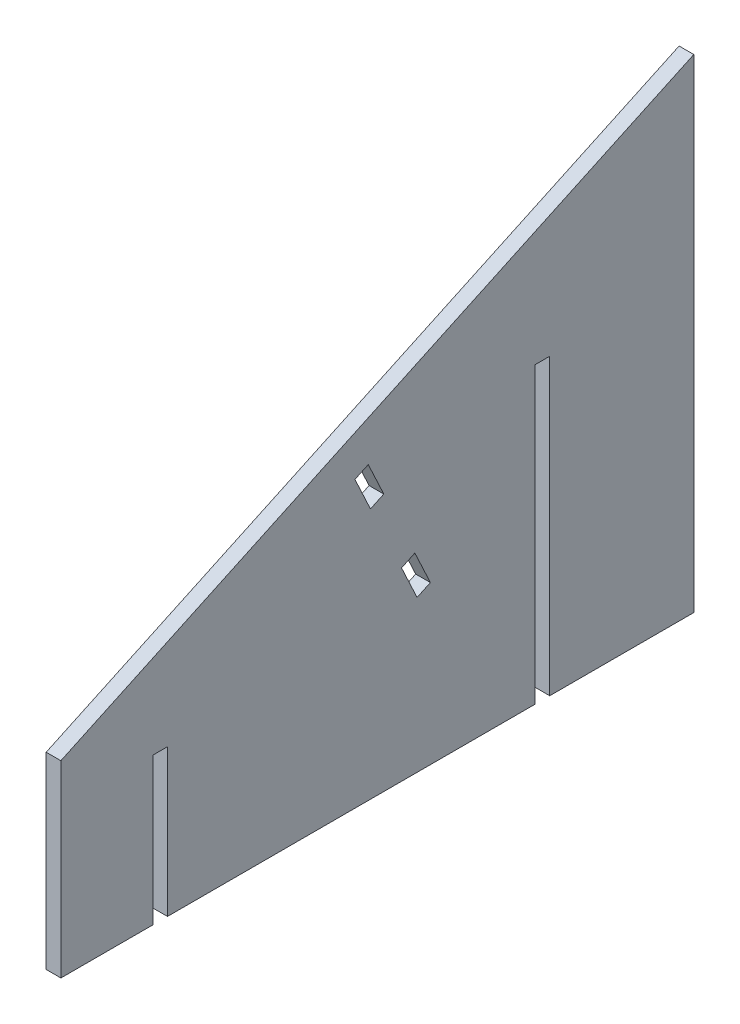
ISO-10303-21;
HEADER;
FILE_DESCRIPTION(('STEP AP214'),'2;1');
FILE_NAME('part.step','',(''),(''),'','','');
FILE_SCHEMA(('AUTOMOTIVE_DESIGN { 1 0 10303 214 1 1 1 1 }'));
ENDSEC;
DATA;
#1=APPLICATION_CONTEXT('core data for automotive mechanical design processes');
#2=APPLICATION_PROTOCOL_DEFINITION('international standard','automotive_design',2000,#1);
#3=PRODUCT_CONTEXT('',#1,'mechanical');
#4=PRODUCT('Part','Part','',(#3));
#5=PRODUCT_RELATED_PRODUCT_CATEGORY('part','',(#4));
#6=PRODUCT_DEFINITION_FORMATION('','',#4);
#7=PRODUCT_DEFINITION_CONTEXT('part definition',#1,'design');
#8=PRODUCT_DEFINITION('design','',#6,#7);
#9=PRODUCT_DEFINITION_SHAPE('','',#8);
#10=(LENGTH_UNIT() NAMED_UNIT(*) SI_UNIT(.MILLI.,.METRE.));
#11=(NAMED_UNIT(*) PLANE_ANGLE_UNIT() SI_UNIT($,.RADIAN.));
#12=(NAMED_UNIT(*) SI_UNIT($,.STERADIAN.) SOLID_ANGLE_UNIT());
#13=UNCERTAINTY_MEASURE_WITH_UNIT(LENGTH_MEASURE(1.E-05),#10,'distance_accuracy_value','');
#14=(GEOMETRIC_REPRESENTATION_CONTEXT(3) GLOBAL_UNCERTAINTY_ASSIGNED_CONTEXT((#13)) GLOBAL_UNIT_ASSIGNED_CONTEXT((#10,
#11,#12)) REPRESENTATION_CONTEXT('',''));
#15=CARTESIAN_POINT('',(0.,0.,0.));
#16=DIRECTION('',(0.,0.,1.));
#17=DIRECTION('',(1.,0.,0.));
#18=AXIS2_PLACEMENT_3D('',#15,#16,#17);
#19=CARTESIAN_POINT('',(5.08,-65.024,0.));
#20=DIRECTION('',(0.,1.,0.));
#21=DIRECTION('',(0.,0.,1.));
#22=AXIS2_PLACEMENT_3D('',#19,#20,#21);
#23=PLANE('',#22);
#24=DIRECTION('',(0.,0.,-1.));
#25=VECTOR('',#24,1.);
#26=CARTESIAN_POINT('',(0.,-65.024,0.));
#27=LINE('',#26,#25);
#28=CARTESIAN_POINT('',(0.,-65.024,0.));
#29=VERTEX_POINT('',#28);
#30=CARTESIAN_POINT('',(0.,-65.024,-31.75));
#31=VERTEX_POINT('',#30);
#32=EDGE_CURVE('E184',#29,#31,#27,.T.);
#33=ORIENTED_EDGE('',*,*,#32,.T.);
#34=DIRECTION('',(1.,0.,0.));
#35=VECTOR('',#34,1.);
#36=CARTESIAN_POINT('',(0.,-65.024,-31.75));
#37=LINE('',#36,#35);
#38=CARTESIAN_POINT('',(5.08,-65.024,-31.75));
#39=VERTEX_POINT('',#38);
#40=EDGE_CURVE('E170',#31,#39,#37,.T.);
#41=ORIENTED_EDGE('',*,*,#40,.T.);
#42=DIRECTION('',(0.,0.,-1.));
#43=VECTOR('',#42,1.);
#44=CARTESIAN_POINT('',(5.08,-65.024,0.));
#45=LINE('',#44,#43);
#46=CARTESIAN_POINT('',(5.08,-65.024,0.));
#47=VERTEX_POINT('',#46);
#48=EDGE_CURVE('E216',#47,#39,#45,.T.);
#49=ORIENTED_EDGE('',*,*,#48,.F.);
#50=DIRECTION('',(-1.,0.,0.));
#51=VECTOR('',#50,1.);
#52=CARTESIAN_POINT('',(5.08,-65.024,0.));
#53=LINE('',#52,#51);
#54=EDGE_CURVE('E11',#47,#29,#53,.T.);
#55=ORIENTED_EDGE('',*,*,#54,.T.);
#56=EDGE_LOOP('',(#33,#41,#49,#55));
#57=FACE_BOUND('',#56,.T.);
#58=ADVANCED_FACE('F33',(#57),#23,.F.);
#59=CARTESIAN_POINT('',(5.08,-65.024,-36.83));
#60=VERTEX_POINT('',#59);
#61=CARTESIAN_POINT('',(5.08,-65.024,-163.83));
#62=VERTEX_POINT('',#61);
#63=EDGE_CURVE('E218',#60,#62,#45,.T.);
#64=ORIENTED_EDGE('',*,*,#63,.F.);
#65=DIRECTION('',(1.,0.,0.));
#66=VECTOR('',#65,1.);
#67=CARTESIAN_POINT('',(0.,-65.024,-36.83));
#68=LINE('',#67,#66);
#69=CARTESIAN_POINT('',(0.,-65.024,-36.83));
#70=VERTEX_POINT('',#69);
#71=EDGE_CURVE('E179',#70,#60,#68,.T.);
#72=ORIENTED_EDGE('',*,*,#71,.F.);
#73=CARTESIAN_POINT('',(0.,-65.024,-163.83));
#74=VERTEX_POINT('',#73);
#75=EDGE_CURVE('E192',#70,#74,#27,.T.);
#76=ORIENTED_EDGE('',*,*,#75,.T.);
#77=DIRECTION('',(1.,0.,0.));
#78=VECTOR('',#77,1.);
#79=CARTESIAN_POINT('',(0.,-65.024,-163.83));
#80=LINE('',#79,#78);
#81=EDGE_CURVE('E285',#74,#62,#80,.T.);
#82=ORIENTED_EDGE('',*,*,#81,.T.);
#83=EDGE_LOOP('',(#64,#72,#76,#82));
#84=FACE_BOUND('',#83,.T.);
#85=ADVANCED_FACE('F327',(#84),#23,.F.);
#86=CARTESIAN_POINT('',(5.08,0.,0.));
#87=DIRECTION('',(0.,0.,-1.));
#88=DIRECTION('',(0.,1.,0.));
#89=AXIS2_PLACEMENT_3D('',#86,#87,#88);
#90=PLANE('',#89);
#91=DIRECTION('',(0.,-1.,0.));
#92=VECTOR('',#91,1.);
#93=CARTESIAN_POINT('',(0.,0.,0.));
#94=LINE('',#93,#92);
#95=CARTESIAN_POINT('',(0.,0.,0.));
#96=VERTEX_POINT('',#95);
#97=EDGE_CURVE('E199',#96,#29,#94,.T.);
#98=ORIENTED_EDGE('',*,*,#97,.T.);
#99=ORIENTED_EDGE('',*,*,#54,.F.);
#100=DIRECTION('',(0.,-1.,0.));
#101=VECTOR('',#100,1.);
#102=CARTESIAN_POINT('',(5.08,0.,0.));
#103=LINE('',#102,#101);
#104=CARTESIAN_POINT('',(5.08,0.,0.));
#105=VERTEX_POINT('',#104);
#106=EDGE_CURVE('E220',#105,#47,#103,.T.);
#107=ORIENTED_EDGE('',*,*,#106,.F.);
#108=DIRECTION('',(-1.,0.,0.));
#109=VECTOR('',#108,1.);
#110=CARTESIAN_POINT('',(5.08,0.,0.));
#111=LINE('',#110,#109);
#112=EDGE_CURVE('E213',#105,#96,#111,.T.);
#113=ORIENTED_EDGE('',*,*,#112,.T.);
#114=EDGE_LOOP('',(#98,#99,#107,#113));
#115=FACE_BOUND('',#114,.T.);
#116=ADVANCED_FACE('F35',(#115),#90,.F.);
#117=CARTESIAN_POINT('',(5.08,-65.024,-168.91));
#118=VERTEX_POINT('',#117);
#119=CARTESIAN_POINT('',(5.08,-65.024,-218.692069011943));
#120=VERTEX_POINT('',#119);
#121=EDGE_CURVE('E219',#118,#120,#45,.T.);
#122=ORIENTED_EDGE('',*,*,#121,.F.);
#123=DIRECTION('',(1.,0.,0.));
#124=VECTOR('',#123,1.);
#125=CARTESIAN_POINT('',(0.,-65.024,-168.91));
#126=LINE('',#125,#124);
#127=CARTESIAN_POINT('',(0.,-65.024,-168.91));
#128=VERTEX_POINT('',#127);
#129=EDGE_CURVE('E288',#128,#118,#126,.T.);
#130=ORIENTED_EDGE('',*,*,#129,.F.);
#131=CARTESIAN_POINT('',(0.,-65.024,-218.692069011943));
#132=VERTEX_POINT('',#131);
#133=EDGE_CURVE('E194',#128,#132,#27,.T.);
#134=ORIENTED_EDGE('',*,*,#133,.T.);
#135=DIRECTION('',(-1.,0.,0.));
#136=VECTOR('',#135,1.);
#137=CARTESIAN_POINT('',(5.08,-65.024,-218.692069011943));
#138=LINE('',#137,#136);
#139=EDGE_CURVE('E41',#120,#132,#138,.T.);
#140=ORIENTED_EDGE('',*,*,#139,.F.);
#141=EDGE_LOOP('',(#122,#130,#134,#140));
#142=FACE_BOUND('',#141,.T.);
#143=ADVANCED_FACE('F338',(#142),#23,.F.);
#144=CARTESIAN_POINT('',(5.08,101.977786558031,-218.692069011943));
#145=DIRECTION('',(0.,0.,1.));
#146=DIRECTION('',(0.,-1.,0.));
#147=AXIS2_PLACEMENT_3D('',#144,#145,#146);
#148=PLANE('',#147);
#149=DIRECTION('',(0.,1.,0.));
#150=VECTOR('',#149,1.);
#151=CARTESIAN_POINT('',(0.,101.977786558031,-218.692069011943));
#152=LINE('',#151,#150);
#153=CARTESIAN_POINT('',(0.,101.977786558031,-218.692069011943));
#154=VERTEX_POINT('',#153);
#155=EDGE_CURVE('E191',#132,#154,#152,.T.);
#156=ORIENTED_EDGE('',*,*,#155,.T.);
#157=DIRECTION('',(-1.,0.,0.));
#158=VECTOR('',#157,1.);
#159=CARTESIAN_POINT('',(5.08,101.977786558031,-218.692069011943));
#160=LINE('',#159,#158);
#161=CARTESIAN_POINT('',(5.08,101.977786558031,-218.692069011943));
#162=VERTEX_POINT('',#161);
#163=EDGE_CURVE('E341',#162,#154,#160,.T.);
#164=ORIENTED_EDGE('',*,*,#163,.F.);
#165=DIRECTION('',(0.,1.,0.));
#166=VECTOR('',#165,1.);
#167=CARTESIAN_POINT('',(5.08,101.977786558031,-218.692069011943));
#168=LINE('',#167,#166);
#169=EDGE_CURVE('E214',#120,#162,#168,.T.);
#170=ORIENTED_EDGE('',*,*,#169,.F.);
#171=ORIENTED_EDGE('',*,*,#139,.T.);
#172=EDGE_LOOP('',(#156,#164,#170,#171));
#173=FACE_BOUND('',#172,.T.);
#174=ADVANCED_FACE('F342',(#173),#148,.F.);
#175=CARTESIAN_POINT('',(5.08,0.,0.));
#176=DIRECTION('',(0.,-0.906307787036649,-0.422618261740701));
#177=DIRECTION('',(0.,0.422618261740701,-0.906307787036649));
#178=AXIS2_PLACEMENT_3D('',#175,#176,#177);
#179=PLANE('',#178);
#180=DIRECTION('',(0.,-0.422618261740701,0.906307787036649));
#181=VECTOR('',#180,1.);
#182=CARTESIAN_POINT('',(0.,0.,0.));
#183=LINE('',#182,#181);
#184=EDGE_CURVE('E195',#154,#96,#183,.T.);
#185=ORIENTED_EDGE('',*,*,#184,.T.);
#186=ORIENTED_EDGE('',*,*,#112,.F.);
#187=DIRECTION('',(0.,-0.422618261740701,0.906307787036649));
#188=VECTOR('',#187,1.);
#189=CARTESIAN_POINT('',(5.08,0.,0.));
#190=LINE('',#189,#188);
#191=EDGE_CURVE('E211',#162,#105,#190,.T.);
#192=ORIENTED_EDGE('',*,*,#191,.F.);
#193=ORIENTED_EDGE('',*,*,#163,.T.);
#194=EDGE_LOOP('',(#185,#186,#192,#193));
#195=FACE_BOUND('',#194,.T.);
#196=ADVANCED_FACE('F349',(#195),#179,.F.);
#197=CARTESIAN_POINT('',(5.08,0.,0.));
#198=DIRECTION('',(1.,0.,0.));
#199=DIRECTION('',(0.,0.,-1.));
#200=AXIS2_PLACEMENT_3D('',#197,#198,#199);
#201=PLANE('',#200);
#202=DIRECTION('',(0.,-1.,0.));
#203=VECTOR('',#202,1.);
#204=CARTESIAN_POINT('',(5.08,-65.024,-31.75));
#205=LINE('',#204,#203);
#206=CARTESIAN_POINT('',(5.08,-14.224,-31.75));
#207=VERTEX_POINT('',#206);
#208=EDGE_CURVE('E175',#207,#39,#205,.T.);
#209=ORIENTED_EDGE('',*,*,#208,.F.);
#210=DIRECTION('',(0.,0.,1.));
#211=VECTOR('',#210,1.);
#212=CARTESIAN_POINT('',(5.08,-14.224,-31.75));
#213=LINE('',#212,#211);
#214=CARTESIAN_POINT('',(5.08,-14.224,-36.83));
#215=VERTEX_POINT('',#214);
#216=EDGE_CURVE('E187',#215,#207,#213,.T.);
#217=ORIENTED_EDGE('',*,*,#216,.F.);
#218=DIRECTION('',(0.,1.,0.));
#219=VECTOR('',#218,1.);
#220=CARTESIAN_POINT('',(5.08,-65.024,-36.83));
#221=LINE('',#220,#219);
#222=EDGE_CURVE('E315',#60,#215,#221,.T.);
#223=ORIENTED_EDGE('',*,*,#222,.F.);
#224=ORIENTED_EDGE('',*,*,#63,.T.);
#225=DIRECTION('',(0.,-1.,0.));
#226=VECTOR('',#225,1.);
#227=CARTESIAN_POINT('',(5.08,-65.024,-163.83));
#228=LINE('',#227,#226);
#229=CARTESIAN_POINT('',(5.08,36.576,-163.83));
#230=VERTEX_POINT('',#229);
#231=EDGE_CURVE('E301',#230,#62,#228,.T.);
#232=ORIENTED_EDGE('',*,*,#231,.F.);
#233=DIRECTION('',(0.,0.,1.));
#234=VECTOR('',#233,1.);
#235=CARTESIAN_POINT('',(5.08,36.576,-163.83));
#236=LINE('',#235,#234);
#237=CARTESIAN_POINT('',(5.08,36.576,-168.91));
#238=VERTEX_POINT('',#237);
#239=EDGE_CURVE('E294',#238,#230,#236,.T.);
#240=ORIENTED_EDGE('',*,*,#239,.F.);
#241=DIRECTION('',(0.,1.,0.));
#242=VECTOR('',#241,1.);
#243=CARTESIAN_POINT('',(5.08,-65.024,-168.91));
#244=LINE('',#243,#242);
#245=EDGE_CURVE('E298',#118,#238,#244,.T.);
#246=ORIENTED_EDGE('',*,*,#245,.F.);
#247=ORIENTED_EDGE('',*,*,#121,.T.);
#248=ORIENTED_EDGE('',*,*,#169,.T.);
#249=ORIENTED_EDGE('',*,*,#191,.T.);
#250=ORIENTED_EDGE('',*,*,#106,.T.);
#251=ORIENTED_EDGE('',*,*,#48,.T.);
#252=EDGE_LOOP('',(#209,#217,#223,#224,#232,#240,#246,#247,#248,#249,#250,#251));
#253=FACE_BOUND('',#252,.T.);
#254=DIRECTION('',(0.,-0.90630778703665,-0.4226182617407));
#255=VECTOR('',#254,1.);
#256=CARTESIAN_POINT('',(5.08,-1.16636818837194,-117.701755772321));
#257=LINE('',#256,#255);
#258=CARTESIAN_POINT('',(5.08,-1.16636818837194,-117.701755772321));
#259=VERTEX_POINT('',#258);
#260=CARTESIAN_POINT('',(5.08,-12.6764770837374,-123.069007696428));
#261=VERTEX_POINT('',#260);
#262=EDGE_CURVE('E272',#259,#261,#257,.T.);
#263=ORIENTED_EDGE('',*,*,#262,.F.);
#264=DIRECTION('',(0.,-0.422618261740701,0.906307787036649));
#265=VECTOR('',#264,1.);
#266=CARTESIAN_POINT('',(5.08,-1.16636818837194,-117.701755772321));
#267=LINE('',#266,#265);
#268=CARTESIAN_POINT('',(5.08,0.980532581270822,-122.305799330467));
#269=VERTEX_POINT('',#268);
#270=EDGE_CURVE('E262',#269,#259,#267,.T.);
#271=ORIENTED_EDGE('',*,*,#270,.F.);
#272=DIRECTION('',(0.,0.906307787036649,0.422618261740701));
#273=VECTOR('',#272,1.);
#274=CARTESIAN_POINT('',(5.08,0.980532581270822,-122.305799330467));
#275=LINE('',#274,#273);
#276=CARTESIAN_POINT('',(5.08,-10.5295763140946,-127.673051254574));
#277=VERTEX_POINT('',#276);
#278=EDGE_CURVE('E266',#277,#269,#275,.T.);
#279=ORIENTED_EDGE('',*,*,#278,.F.);
#280=DIRECTION('',(0.,0.422618261740701,-0.906307787036649));
#281=VECTOR('',#280,1.);
#282=CARTESIAN_POINT('',(5.08,-12.6764770837374,-123.069007696428));
#283=LINE('',#282,#281);
#284=EDGE_CURVE('E269',#261,#277,#283,.T.);
#285=ORIENTED_EDGE('',*,*,#284,.F.);
#286=EDGE_LOOP('',(#263,#271,#279,#285));
#287=FACE_BOUND('',#286,.T.);
#288=DIRECTION('',(0.,-0.90630778703665,-0.4226182617407));
#289=VECTOR('',#288,1.);
#290=CARTESIAN_POINT('',(5.08,33.3639584977244,-101.6));
#291=LINE('',#290,#289);
#292=CARTESIAN_POINT('',(5.08,33.3639584977244,-101.6));
#293=VERTEX_POINT('',#292);
#294=CARTESIAN_POINT('',(5.08,21.853849602359,-106.967251924107));
#295=VERTEX_POINT('',#294);
#296=EDGE_CURVE('E240',#293,#295,#291,.T.);
#297=ORIENTED_EDGE('',*,*,#296,.F.);
#298=DIRECTION('',(0.,-0.422618261740701,0.906307787036649));
#299=VECTOR('',#298,1.);
#300=CARTESIAN_POINT('',(5.08,33.3639584977244,-101.6));
#301=LINE('',#300,#299);
#302=CARTESIAN_POINT('',(5.08,35.5108592673672,-106.204043558146));
#303=VERTEX_POINT('',#302);
#304=EDGE_CURVE('E230',#303,#293,#301,.T.);
#305=ORIENTED_EDGE('',*,*,#304,.F.);
#306=DIRECTION('',(0.,0.906307787036649,0.422618261740701));
#307=VECTOR('',#306,1.);
#308=CARTESIAN_POINT('',(5.08,35.5108592673672,-106.204043558146));
#309=LINE('',#308,#307);
#310=CARTESIAN_POINT('',(5.08,24.0007503720017,-111.571295482253));
#311=VERTEX_POINT('',#310);
#312=EDGE_CURVE('E234',#311,#303,#309,.T.);
#313=ORIENTED_EDGE('',*,*,#312,.F.);
#314=DIRECTION('',(0.,0.422618261740701,-0.906307787036649));
#315=VECTOR('',#314,1.);
#316=CARTESIAN_POINT('',(5.08,21.853849602359,-106.967251924107));
#317=LINE('',#316,#315);
#318=EDGE_CURVE('E237',#295,#311,#317,.T.);
#319=ORIENTED_EDGE('',*,*,#318,.F.);
#320=EDGE_LOOP('',(#297,#305,#313,#319));
#321=FACE_BOUND('',#320,.T.);
#322=ADVANCED_FACE('F333',(#253,#287,#321),#201,.T.);
#323=CARTESIAN_POINT('',(0.,0.,0.));
#324=DIRECTION('',(1.,0.,0.));
#325=DIRECTION('',(0.,0.,-1.));
#326=AXIS2_PLACEMENT_3D('',#323,#324,#325);
#327=PLANE('',#326);
#328=DIRECTION('',(0.,-0.422618261740701,0.906307787036649));
#329=VECTOR('',#328,1.);
#330=CARTESIAN_POINT('',(0.,-1.16636818837194,-117.701755772321));
#331=LINE('',#330,#329);
#332=CARTESIAN_POINT('',(0.,0.980532581270822,-122.305799330467));
#333=VERTEX_POINT('',#332);
#334=CARTESIAN_POINT('',(0.,-1.16636818837194,-117.701755772321));
#335=VERTEX_POINT('',#334);
#336=EDGE_CURVE('E257',#333,#335,#331,.T.);
#337=ORIENTED_EDGE('',*,*,#336,.T.);
#338=DIRECTION('',(0.,-0.90630778703665,-0.4226182617407));
#339=VECTOR('',#338,1.);
#340=CARTESIAN_POINT('',(0.,-1.16636818837194,-117.701755772321));
#341=LINE('',#340,#339);
#342=CARTESIAN_POINT('',(0.,-12.6764770837374,-123.069007696428));
#343=VERTEX_POINT('',#342);
#344=EDGE_CURVE('E265',#335,#343,#341,.T.);
#345=ORIENTED_EDGE('',*,*,#344,.T.);
#346=DIRECTION('',(0.,0.422618261740701,-0.906307787036649));
#347=VECTOR('',#346,1.);
#348=CARTESIAN_POINT('',(0.,-12.6764770837374,-123.069007696428));
#349=LINE('',#348,#347);
#350=CARTESIAN_POINT('',(0.,-10.5295763140946,-127.673051254574));
#351=VERTEX_POINT('',#350);
#352=EDGE_CURVE('E280',#343,#351,#349,.T.);
#353=ORIENTED_EDGE('',*,*,#352,.T.);
#354=DIRECTION('',(0.,0.906307787036649,0.422618261740701));
#355=VECTOR('',#354,1.);
#356=CARTESIAN_POINT('',(0.,0.980532581270822,-122.305799330467));
#357=LINE('',#356,#355);
#358=EDGE_CURVE('E277',#351,#333,#357,.T.);
#359=ORIENTED_EDGE('',*,*,#358,.T.);
#360=EDGE_LOOP('',(#337,#345,#353,#359));
#361=FACE_BOUND('',#360,.T.);
#362=DIRECTION('',(0.,-0.422618261740701,0.906307787036649));
#363=VECTOR('',#362,1.);
#364=CARTESIAN_POINT('',(0.,33.3639584977244,-101.6));
#365=LINE('',#364,#363);
#366=CARTESIAN_POINT('',(0.,35.5108592673672,-106.204043558146));
#367=VERTEX_POINT('',#366);
#368=CARTESIAN_POINT('',(0.,33.3639584977244,-101.6));
#369=VERTEX_POINT('',#368);
#370=EDGE_CURVE('E227',#367,#369,#365,.T.);
#371=ORIENTED_EDGE('',*,*,#370,.T.);
#372=DIRECTION('',(0.,-0.90630778703665,-0.4226182617407));
#373=VECTOR('',#372,1.);
#374=CARTESIAN_POINT('',(0.,33.3639584977244,-101.6));
#375=LINE('',#374,#373);
#376=CARTESIAN_POINT('',(0.,21.853849602359,-106.967251924107));
#377=VERTEX_POINT('',#376);
#378=EDGE_CURVE('E233',#369,#377,#375,.T.);
#379=ORIENTED_EDGE('',*,*,#378,.T.);
#380=DIRECTION('',(0.,0.422618261740701,-0.906307787036649));
#381=VECTOR('',#380,1.);
#382=CARTESIAN_POINT('',(0.,21.853849602359,-106.967251924107));
#383=LINE('',#382,#381);
#384=CARTESIAN_POINT('',(0.,24.0007503720017,-111.571295482253));
#385=VERTEX_POINT('',#384);
#386=EDGE_CURVE('E248',#377,#385,#383,.T.);
#387=ORIENTED_EDGE('',*,*,#386,.T.);
#388=DIRECTION('',(0.,0.906307787036649,0.422618261740701));
#389=VECTOR('',#388,1.);
#390=CARTESIAN_POINT('',(0.,35.5108592673672,-106.204043558146));
#391=LINE('',#390,#389);
#392=EDGE_CURVE('E245',#385,#367,#391,.T.);
#393=ORIENTED_EDGE('',*,*,#392,.T.);
#394=EDGE_LOOP('',(#371,#379,#387,#393));
#395=FACE_BOUND('',#394,.T.);
#396=DIRECTION('',(0.,0.,1.));
#397=VECTOR('',#396,1.);
#398=CARTESIAN_POINT('',(0.,-14.224,-31.75));
#399=LINE('',#398,#397);
#400=CARTESIAN_POINT('',(0.,-14.224,-36.83));
#401=VERTEX_POINT('',#400);
#402=CARTESIAN_POINT('',(0.,-14.224,-31.75));
#403=VERTEX_POINT('',#402);
#404=EDGE_CURVE('E48',#401,#403,#399,.T.);
#405=ORIENTED_EDGE('',*,*,#404,.T.);
#406=DIRECTION('',(0.,-1.,0.));
#407=VECTOR('',#406,1.);
#408=CARTESIAN_POINT('',(0.,-65.024,-31.75));
#409=LINE('',#408,#407);
#410=EDGE_CURVE('E173',#403,#31,#409,.T.);
#411=ORIENTED_EDGE('',*,*,#410,.T.);
#412=ORIENTED_EDGE('',*,*,#32,.F.);
#413=ORIENTED_EDGE('',*,*,#97,.F.);
#414=ORIENTED_EDGE('',*,*,#184,.F.);
#415=ORIENTED_EDGE('',*,*,#155,.F.);
#416=ORIENTED_EDGE('',*,*,#133,.F.);
#417=DIRECTION('',(0.,1.,0.));
#418=VECTOR('',#417,1.);
#419=CARTESIAN_POINT('',(0.,-65.024,-168.91));
#420=LINE('',#419,#418);
#421=CARTESIAN_POINT('',(0.,36.576,-168.91));
#422=VERTEX_POINT('',#421);
#423=EDGE_CURVE('E304',#128,#422,#420,.T.);
#424=ORIENTED_EDGE('',*,*,#423,.T.);
#425=DIRECTION('',(0.,0.,1.));
#426=VECTOR('',#425,1.);
#427=CARTESIAN_POINT('',(0.,36.576,-163.83));
#428=LINE('',#427,#426);
#429=CARTESIAN_POINT('',(0.,36.576,-163.83));
#430=VERTEX_POINT('',#429);
#431=EDGE_CURVE('E56',#422,#430,#428,.T.);
#432=ORIENTED_EDGE('',*,*,#431,.T.);
#433=DIRECTION('',(0.,-1.,0.));
#434=VECTOR('',#433,1.);
#435=CARTESIAN_POINT('',(0.,-65.024,-163.83));
#436=LINE('',#435,#434);
#437=EDGE_CURVE('E297',#430,#74,#436,.T.);
#438=ORIENTED_EDGE('',*,*,#437,.T.);
#439=ORIENTED_EDGE('',*,*,#75,.F.);
#440=DIRECTION('',(0.,1.,0.));
#441=VECTOR('',#440,1.);
#442=CARTESIAN_POINT('',(0.,-65.024,-36.83));
#443=LINE('',#442,#441);
#444=EDGE_CURVE('E186',#70,#401,#443,.T.);
#445=ORIENTED_EDGE('',*,*,#444,.T.);
#446=EDGE_LOOP('',(#405,#411,#412,#413,#414,#415,#416,#424,#432,#438,#439,#445));
#447=FACE_BOUND('',#446,.T.);
#448=ADVANCED_FACE('F182',(#361,#395,#447),#327,.F.);
#449=CARTESIAN_POINT('',(0.,33.3639584977244,-101.6));
#450=DIRECTION('',(0.,-0.4226182617407,0.90630778703665));
#451=DIRECTION('',(0.,-0.90630778703665,-0.4226182617407));
#452=AXIS2_PLACEMENT_3D('',#449,#450,#451);
#453=PLANE('',#452);
#454=ORIENTED_EDGE('',*,*,#296,.T.);
#455=DIRECTION('',(1.,0.,0.));
#456=VECTOR('',#455,1.);
#457=CARTESIAN_POINT('',(0.,21.853849602359,-106.967251924107));
#458=LINE('',#457,#456);
#459=EDGE_CURVE('E223',#377,#295,#458,.T.);
#460=ORIENTED_EDGE('',*,*,#459,.F.);
#461=ORIENTED_EDGE('',*,*,#378,.F.);
#462=DIRECTION('',(1.,0.,0.));
#463=VECTOR('',#462,1.);
#464=CARTESIAN_POINT('',(0.,33.3639584977244,-101.6));
#465=LINE('',#464,#463);
#466=EDGE_CURVE('E205',#369,#293,#465,.T.);
#467=ORIENTED_EDGE('',*,*,#466,.T.);
#468=EDGE_LOOP('',(#454,#460,#461,#467));
#469=FACE_BOUND('',#468,.T.);
#470=ADVANCED_FACE('F368',(#469),#453,.F.);
#471=CARTESIAN_POINT('',(0.,33.3639584977244,-101.6));
#472=DIRECTION('',(0.,0.906307787036649,0.422618261740701));
#473=DIRECTION('',(0.,-0.422618261740701,0.906307787036649));
#474=AXIS2_PLACEMENT_3D('',#471,#472,#473);
#475=PLANE('',#474);
#476=ORIENTED_EDGE('',*,*,#304,.T.);
#477=ORIENTED_EDGE('',*,*,#466,.F.);
#478=ORIENTED_EDGE('',*,*,#370,.F.);
#479=DIRECTION('',(1.,0.,0.));
#480=VECTOR('',#479,1.);
#481=CARTESIAN_POINT('',(0.,35.5108592673672,-106.204043558146));
#482=LINE('',#481,#480);
#483=EDGE_CURVE('E208',#367,#303,#482,.T.);
#484=ORIENTED_EDGE('',*,*,#483,.T.);
#485=EDGE_LOOP('',(#476,#477,#478,#484));
#486=FACE_BOUND('',#485,.T.);
#487=ADVANCED_FACE('F374',(#486),#475,.F.);
#488=CARTESIAN_POINT('',(0.,35.5108592673672,-106.204043558146));
#489=DIRECTION('',(0.,0.422618261740701,-0.906307787036649));
#490=DIRECTION('',(0.,0.906307787036649,0.422618261740701));
#491=AXIS2_PLACEMENT_3D('',#488,#489,#490);
#492=PLANE('',#491);
#493=ORIENTED_EDGE('',*,*,#312,.T.);
#494=ORIENTED_EDGE('',*,*,#483,.F.);
#495=ORIENTED_EDGE('',*,*,#392,.F.);
#496=DIRECTION('',(1.,0.,0.));
#497=VECTOR('',#496,1.);
#498=CARTESIAN_POINT('',(0.,24.0007503720017,-111.571295482253));
#499=LINE('',#498,#497);
#500=EDGE_CURVE('E226',#385,#311,#499,.T.);
#501=ORIENTED_EDGE('',*,*,#500,.T.);
#502=EDGE_LOOP('',(#493,#494,#495,#501));
#503=FACE_BOUND('',#502,.T.);
#504=ADVANCED_FACE('F380',(#503),#492,.F.);
#505=CARTESIAN_POINT('',(0.,21.853849602359,-106.967251924107));
#506=DIRECTION('',(0.,-0.906307787036649,-0.422618261740701));
#507=DIRECTION('',(0.,0.422618261740701,-0.906307787036649));
#508=AXIS2_PLACEMENT_3D('',#505,#506,#507);
#509=PLANE('',#508);
#510=ORIENTED_EDGE('',*,*,#318,.T.);
#511=ORIENTED_EDGE('',*,*,#500,.F.);
#512=ORIENTED_EDGE('',*,*,#386,.F.);
#513=ORIENTED_EDGE('',*,*,#459,.T.);
#514=EDGE_LOOP('',(#510,#511,#512,#513));
#515=FACE_BOUND('',#514,.T.);
#516=ADVANCED_FACE('F376',(#515),#509,.F.);
#517=CARTESIAN_POINT('',(0.,-1.16636818837194,-117.701755772321));
#518=DIRECTION('',(0.,-0.4226182617407,0.90630778703665));
#519=DIRECTION('',(0.,-0.90630778703665,-0.4226182617407));
#520=AXIS2_PLACEMENT_3D('',#517,#518,#519);
#521=PLANE('',#520);
#522=ORIENTED_EDGE('',*,*,#262,.T.);
#523=DIRECTION('',(1.,0.,0.));
#524=VECTOR('',#523,1.);
#525=CARTESIAN_POINT('',(0.,-12.6764770837374,-123.069007696428));
#526=LINE('',#525,#524);
#527=EDGE_CURVE('E253',#343,#261,#526,.T.);
#528=ORIENTED_EDGE('',*,*,#527,.F.);
#529=ORIENTED_EDGE('',*,*,#344,.F.);
#530=DIRECTION('',(1.,0.,0.));
#531=VECTOR('',#530,1.);
#532=CARTESIAN_POINT('',(0.,-1.16636818837194,-117.701755772321));
#533=LINE('',#532,#531);
#534=EDGE_CURVE('E242',#335,#259,#533,.T.);
#535=ORIENTED_EDGE('',*,*,#534,.T.);
#536=EDGE_LOOP('',(#522,#528,#529,#535));
#537=FACE_BOUND('',#536,.T.);
#538=ADVANCED_FACE('F379',(#537),#521,.F.);
#539=CARTESIAN_POINT('',(0.,-1.16636818837194,-117.701755772321));
#540=DIRECTION('',(0.,0.906307787036649,0.422618261740701));
#541=DIRECTION('',(0.,-0.422618261740701,0.906307787036649));
#542=AXIS2_PLACEMENT_3D('',#539,#540,#541);
#543=PLANE('',#542);
#544=ORIENTED_EDGE('',*,*,#270,.T.);
#545=ORIENTED_EDGE('',*,*,#534,.F.);
#546=ORIENTED_EDGE('',*,*,#336,.F.);
#547=DIRECTION('',(1.,0.,0.));
#548=VECTOR('',#547,1.);
#549=CARTESIAN_POINT('',(0.,0.980532581270822,-122.305799330467));
#550=LINE('',#549,#548);
#551=EDGE_CURVE('E259',#333,#269,#550,.T.);
#552=ORIENTED_EDGE('',*,*,#551,.T.);
#553=EDGE_LOOP('',(#544,#545,#546,#552));
#554=FACE_BOUND('',#553,.T.);
#555=ADVANCED_FACE('F390',(#554),#543,.F.);
#556=CARTESIAN_POINT('',(0.,0.980532581270822,-122.305799330467));
#557=DIRECTION('',(0.,0.422618261740701,-0.906307787036649));
#558=DIRECTION('',(0.,0.906307787036649,0.422618261740701));
#559=AXIS2_PLACEMENT_3D('',#556,#557,#558);
#560=PLANE('',#559);
#561=ORIENTED_EDGE('',*,*,#278,.T.);
#562=ORIENTED_EDGE('',*,*,#551,.F.);
#563=ORIENTED_EDGE('',*,*,#358,.F.);
#564=DIRECTION('',(1.,0.,0.));
#565=VECTOR('',#564,1.);
#566=CARTESIAN_POINT('',(0.,-10.5295763140946,-127.673051254574));
#567=LINE('',#566,#565);
#568=EDGE_CURVE('E256',#351,#277,#567,.T.);
#569=ORIENTED_EDGE('',*,*,#568,.T.);
#570=EDGE_LOOP('',(#561,#562,#563,#569));
#571=FACE_BOUND('',#570,.T.);
#572=ADVANCED_FACE('F396',(#571),#560,.F.);
#573=CARTESIAN_POINT('',(0.,-12.6764770837374,-123.069007696428));
#574=DIRECTION('',(0.,-0.906307787036649,-0.422618261740701));
#575=DIRECTION('',(0.,0.422618261740701,-0.906307787036649));
#576=AXIS2_PLACEMENT_3D('',#573,#574,#575);
#577=PLANE('',#576);
#578=ORIENTED_EDGE('',*,*,#284,.T.);
#579=ORIENTED_EDGE('',*,*,#568,.F.);
#580=ORIENTED_EDGE('',*,*,#352,.F.);
#581=ORIENTED_EDGE('',*,*,#527,.T.);
#582=EDGE_LOOP('',(#578,#579,#580,#581));
#583=FACE_BOUND('',#582,.T.);
#584=ADVANCED_FACE('F392',(#583),#577,.F.);
#585=CARTESIAN_POINT('',(0.,-65.024,-163.83));
#586=DIRECTION('',(0.,0.,1.));
#587=DIRECTION('',(1.,0.,0.));
#588=AXIS2_PLACEMENT_3D('',#585,#586,#587);
#589=PLANE('',#588);
#590=ORIENTED_EDGE('',*,*,#231,.T.);
#591=ORIENTED_EDGE('',*,*,#81,.F.);
#592=ORIENTED_EDGE('',*,*,#437,.F.);
#593=DIRECTION('',(1.,0.,0.));
#594=VECTOR('',#593,1.);
#595=CARTESIAN_POINT('',(0.,36.576,-163.83));
#596=LINE('',#595,#594);
#597=EDGE_CURVE('E292',#430,#230,#596,.T.);
#598=ORIENTED_EDGE('',*,*,#597,.T.);
#599=EDGE_LOOP('',(#590,#591,#592,#598));
#600=FACE_BOUND('',#599,.T.);
#601=ADVANCED_FACE('F395',(#600),#589,.F.);
#602=CARTESIAN_POINT('',(0.,36.576,-163.83));
#603=DIRECTION('',(0.,1.,0.));
#604=DIRECTION('',(0.,0.,1.));
#605=AXIS2_PLACEMENT_3D('',#602,#603,#604);
#606=PLANE('',#605);
#607=ORIENTED_EDGE('',*,*,#239,.T.);
#608=ORIENTED_EDGE('',*,*,#597,.F.);
#609=ORIENTED_EDGE('',*,*,#431,.F.);
#610=DIRECTION('',(1.,0.,0.));
#611=VECTOR('',#610,1.);
#612=CARTESIAN_POINT('',(0.,36.576,-168.91));
#613=LINE('',#612,#611);
#614=EDGE_CURVE('E290',#422,#238,#613,.T.);
#615=ORIENTED_EDGE('',*,*,#614,.T.);
#616=EDGE_LOOP('',(#607,#608,#609,#615));
#617=FACE_BOUND('',#616,.T.);
#618=ADVANCED_FACE('F406',(#617),#606,.F.);
#619=CARTESIAN_POINT('',(0.,-65.024,-168.91));
#620=DIRECTION('',(0.,0.,-1.));
#621=DIRECTION('',(-1.,0.,0.));
#622=AXIS2_PLACEMENT_3D('',#619,#620,#621);
#623=PLANE('',#622);
#624=ORIENTED_EDGE('',*,*,#245,.T.);
#625=ORIENTED_EDGE('',*,*,#614,.F.);
#626=ORIENTED_EDGE('',*,*,#423,.F.);
#627=ORIENTED_EDGE('',*,*,#129,.T.);
#628=EDGE_LOOP('',(#624,#625,#626,#627));
#629=FACE_BOUND('',#628,.T.);
#630=ADVANCED_FACE('F408',(#629),#623,.F.);
#631=CARTESIAN_POINT('',(0.,-65.024,-31.75));
#632=DIRECTION('',(0.,0.,1.));
#633=DIRECTION('',(1.,0.,0.));
#634=AXIS2_PLACEMENT_3D('',#631,#632,#633);
#635=PLANE('',#634);
#636=ORIENTED_EDGE('',*,*,#208,.T.);
#637=ORIENTED_EDGE('',*,*,#40,.F.);
#638=ORIENTED_EDGE('',*,*,#410,.F.);
#639=DIRECTION('',(1.,0.,0.));
#640=VECTOR('',#639,1.);
#641=CARTESIAN_POINT('',(0.,-14.224,-31.75));
#642=LINE('',#641,#640);
#643=EDGE_CURVE('E274',#403,#207,#642,.T.);
#644=ORIENTED_EDGE('',*,*,#643,.T.);
#645=EDGE_LOOP('',(#636,#637,#638,#644));
#646=FACE_BOUND('',#645,.T.);
#647=ADVANCED_FACE('F172',(#646),#635,.F.);
#648=CARTESIAN_POINT('',(0.,-14.224,-31.75));
#649=DIRECTION('',(0.,1.,0.));
#650=DIRECTION('',(0.,0.,1.));
#651=AXIS2_PLACEMENT_3D('',#648,#649,#650);
#652=PLANE('',#651);
#653=ORIENTED_EDGE('',*,*,#216,.T.);
#654=ORIENTED_EDGE('',*,*,#643,.F.);
#655=ORIENTED_EDGE('',*,*,#404,.F.);
#656=DIRECTION('',(1.,0.,0.));
#657=VECTOR('',#656,1.);
#658=CARTESIAN_POINT('',(0.,-14.224,-36.83));
#659=LINE('',#658,#657);
#660=EDGE_CURVE('E310',#401,#215,#659,.T.);
#661=ORIENTED_EDGE('',*,*,#660,.T.);
#662=EDGE_LOOP('',(#653,#654,#655,#661));
#663=FACE_BOUND('',#662,.T.);
#664=ADVANCED_FACE('F416',(#663),#652,.F.);
#665=CARTESIAN_POINT('',(0.,-65.024,-36.83));
#666=DIRECTION('',(0.,0.,-1.));
#667=DIRECTION('',(-1.,0.,0.));
#668=AXIS2_PLACEMENT_3D('',#665,#666,#667);
#669=PLANE('',#668);
#670=ORIENTED_EDGE('',*,*,#222,.T.);
#671=ORIENTED_EDGE('',*,*,#660,.F.);
#672=ORIENTED_EDGE('',*,*,#444,.F.);
#673=ORIENTED_EDGE('',*,*,#71,.T.);
#674=EDGE_LOOP('',(#670,#671,#672,#673));
#675=FACE_BOUND('',#674,.T.);
#676=ADVANCED_FACE('F323',(#675),#669,.F.);
#677=CLOSED_SHELL('',(#58,#85,#116,#143,#174,#196,#322,#448,#470,#487,#504,#516,#538,#555,#572,
#584,#601,#618,#630,#647,#664,#676));
#678=MANIFOLD_SOLID_BREP('B2',#677);
#679=ADVANCED_BREP_SHAPE_REPRESENTATION('',(#18,#678),#14);
#680=SHAPE_DEFINITION_REPRESENTATION(#9,#679);
ENDSEC;
END-ISO-10303-21;
